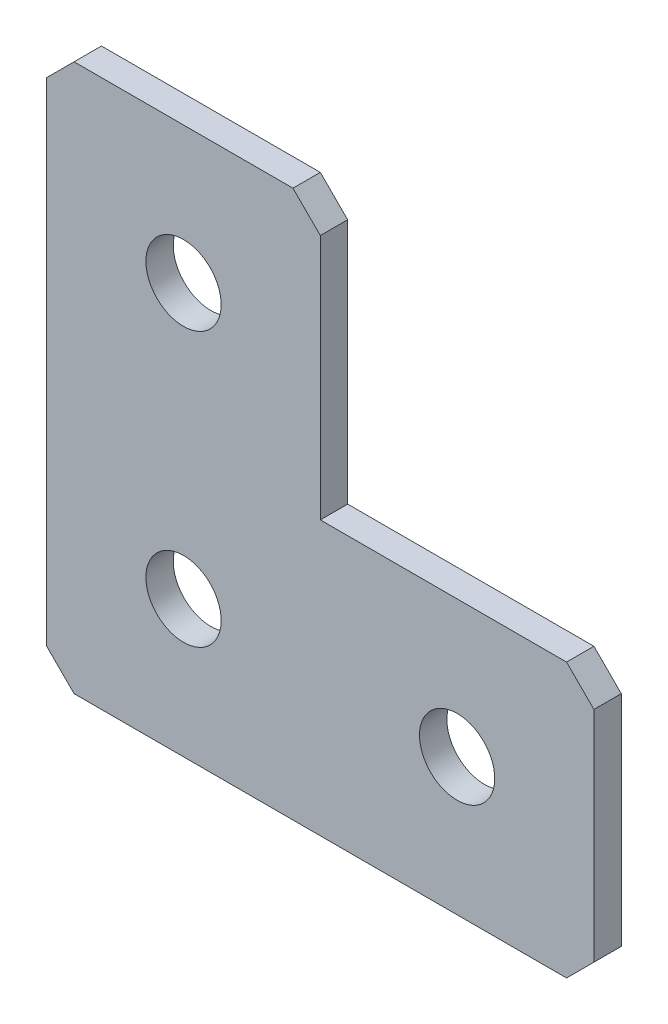
ISO-10303-21;
HEADER;
FILE_DESCRIPTION(('STEP AP214'),'2;1');
FILE_NAME('part.step','',(''),(''),'','','');
FILE_SCHEMA(('AUTOMOTIVE_DESIGN { 1 0 10303 214 1 1 1 1 }'));
ENDSEC;
DATA;
#1=APPLICATION_CONTEXT('core data for automotive mechanical design processes');
#2=APPLICATION_PROTOCOL_DEFINITION('international standard','automotive_design',2000,#1);
#3=PRODUCT_CONTEXT('',#1,'mechanical');
#4=PRODUCT('Part','Part','',(#3));
#5=PRODUCT_RELATED_PRODUCT_CATEGORY('part','',(#4));
#6=PRODUCT_DEFINITION_FORMATION('','',#4);
#7=PRODUCT_DEFINITION_CONTEXT('part definition',#1,'design');
#8=PRODUCT_DEFINITION('design','',#6,#7);
#9=PRODUCT_DEFINITION_SHAPE('','',#8);
#10=(LENGTH_UNIT() NAMED_UNIT(*) SI_UNIT(.MILLI.,.METRE.));
#11=(NAMED_UNIT(*) PLANE_ANGLE_UNIT() SI_UNIT($,.RADIAN.));
#12=(NAMED_UNIT(*) SI_UNIT($,.STERADIAN.) SOLID_ANGLE_UNIT());
#13=UNCERTAINTY_MEASURE_WITH_UNIT(LENGTH_MEASURE(1.E-05),#10,'distance_accuracy_value','');
#14=(GEOMETRIC_REPRESENTATION_CONTEXT(3) GLOBAL_UNCERTAINTY_ASSIGNED_CONTEXT((#13)) GLOBAL_UNIT_ASSIGNED_CONTEXT((#10,
#11,#12)) REPRESENTATION_CONTEXT('',''));
#15=CARTESIAN_POINT('',(0.,0.,0.));
#16=DIRECTION('',(0.,0.,1.));
#17=DIRECTION('',(1.,0.,0.));
#18=AXIS2_PLACEMENT_3D('',#15,#16,#17);
#19=CARTESIAN_POINT('',(20.,0.,-2.));
#20=DIRECTION('',(0.,-1.,0.));
#21=DIRECTION('',(1.,0.,0.));
#22=AXIS2_PLACEMENT_3D('',#19,#20,#21);
#23=PLANE('',#22);
#24=DIRECTION('',(1.,0.,0.));
#25=VECTOR('',#24,1.);
#26=CARTESIAN_POINT('',(20.,0.,-2.));
#27=LINE('',#26,#25);
#28=CARTESIAN_POINT('',(2.,0.,-2.));
#29=VERTEX_POINT('',#28);
#30=CARTESIAN_POINT('',(18.,0.,-2.));
#31=VERTEX_POINT('',#30);
#32=EDGE_CURVE('E140',#29,#31,#27,.T.);
#33=ORIENTED_EDGE('',*,*,#32,.F.);
#34=DIRECTION('',(0.,0.,1.));
#35=VECTOR('',#34,1.);
#36=CARTESIAN_POINT('',(2.,0.,-2.));
#37=LINE('',#36,#35);
#38=CARTESIAN_POINT('',(2.,0.,0.));
#39=VERTEX_POINT('',#38);
#40=EDGE_CURVE('E193',#29,#39,#37,.T.);
#41=ORIENTED_EDGE('',*,*,#40,.T.);
#42=DIRECTION('',(1.,0.,0.));
#43=VECTOR('',#42,1.);
#44=CARTESIAN_POINT('',(20.,0.,0.));
#45=LINE('',#44,#43);
#46=CARTESIAN_POINT('',(18.,0.,0.));
#47=VERTEX_POINT('',#46);
#48=EDGE_CURVE('E170',#39,#47,#45,.T.);
#49=ORIENTED_EDGE('',*,*,#48,.T.);
#50=DIRECTION('',(0.,0.,-1.));
#51=VECTOR('',#50,1.);
#52=CARTESIAN_POINT('',(18.,0.,-2.));
#53=LINE('',#52,#51);
#54=EDGE_CURVE('E151',#47,#31,#53,.T.);
#55=ORIENTED_EDGE('',*,*,#54,.T.);
#56=EDGE_LOOP('',(#33,#41,#49,#55));
#57=FACE_BOUND('',#56,.T.);
#58=ADVANCED_FACE('F42',(#57),#23,.F.);
#59=CARTESIAN_POINT('',(20.,-20.,-2.));
#60=DIRECTION('',(-1.,0.,0.));
#61=DIRECTION('',(0.,-1.,0.));
#62=AXIS2_PLACEMENT_3D('',#59,#60,#61);
#63=PLANE('',#62);
#64=DIRECTION('',(0.,-1.,0.));
#65=VECTOR('',#64,1.);
#66=CARTESIAN_POINT('',(20.,-20.,-2.));
#67=LINE('',#66,#65);
#68=CARTESIAN_POINT('',(20.,-2.,-2.));
#69=VERTEX_POINT('',#68);
#70=CARTESIAN_POINT('',(20.,-20.,-2.));
#71=VERTEX_POINT('',#70);
#72=EDGE_CURVE('E126',#69,#71,#67,.T.);
#73=ORIENTED_EDGE('',*,*,#72,.F.);
#74=DIRECTION('',(0.,0.,1.));
#75=VECTOR('',#74,1.);
#76=CARTESIAN_POINT('',(20.,-2.,-2.));
#77=LINE('',#76,#75);
#78=CARTESIAN_POINT('',(20.,-2.,0.));
#79=VERTEX_POINT('',#78);
#80=EDGE_CURVE('E232',#69,#79,#77,.T.);
#81=ORIENTED_EDGE('',*,*,#80,.T.);
#82=DIRECTION('',(0.,-1.,0.));
#83=VECTOR('',#82,1.);
#84=CARTESIAN_POINT('',(20.,-20.,0.));
#85=LINE('',#84,#83);
#86=CARTESIAN_POINT('',(20.,-20.,0.));
#87=VERTEX_POINT('',#86);
#88=EDGE_CURVE('E146',#79,#87,#85,.T.);
#89=ORIENTED_EDGE('',*,*,#88,.T.);
#90=DIRECTION('',(0.,0.,1.));
#91=VECTOR('',#90,1.);
#92=CARTESIAN_POINT('',(20.,-20.,-2.));
#93=LINE('',#92,#91);
#94=EDGE_CURVE('E143',#71,#87,#93,.T.);
#95=ORIENTED_EDGE('',*,*,#94,.F.);
#96=EDGE_LOOP('',(#73,#81,#89,#95));
#97=FACE_BOUND('',#96,.T.);
#98=ADVANCED_FACE('F144',(#97),#63,.F.);
#99=CARTESIAN_POINT('',(40.,-20.,-2.));
#100=DIRECTION('',(0.,-1.,0.));
#101=DIRECTION('',(0.,0.,-1.));
#102=AXIS2_PLACEMENT_3D('',#99,#100,#101);
#103=PLANE('',#102);
#104=DIRECTION('',(1.,0.,0.));
#105=VECTOR('',#104,1.);
#106=CARTESIAN_POINT('',(40.,-20.,0.));
#107=LINE('',#106,#105);
#108=CARTESIAN_POINT('',(38.,-20.,0.));
#109=VERTEX_POINT('',#108);
#110=EDGE_CURVE('E177',#87,#109,#107,.T.);
#111=ORIENTED_EDGE('',*,*,#110,.T.);
#112=DIRECTION('',(0.,0.,-1.));
#113=VECTOR('',#112,1.);
#114=CARTESIAN_POINT('',(38.,-20.,-2.));
#115=LINE('',#114,#113);
#116=CARTESIAN_POINT('',(38.,-20.,-2.));
#117=VERTEX_POINT('',#116);
#118=EDGE_CURVE('E156',#109,#117,#115,.T.);
#119=ORIENTED_EDGE('',*,*,#118,.T.);
#120=DIRECTION('',(1.,0.,0.));
#121=VECTOR('',#120,1.);
#122=CARTESIAN_POINT('',(40.,-20.,-2.));
#123=LINE('',#122,#121);
#124=EDGE_CURVE('E131',#71,#117,#123,.T.);
#125=ORIENTED_EDGE('',*,*,#124,.F.);
#126=ORIENTED_EDGE('',*,*,#94,.T.);
#127=EDGE_LOOP('',(#111,#119,#125,#126));
#128=FACE_BOUND('',#127,.T.);
#129=ADVANCED_FACE('F154',(#128),#103,.F.);
#130=CARTESIAN_POINT('',(40.,-40.,-2.));
#131=DIRECTION('',(-1.,0.,0.));
#132=DIRECTION('',(0.,0.,1.));
#133=AXIS2_PLACEMENT_3D('',#130,#131,#132);
#134=PLANE('',#133);
#135=DIRECTION('',(0.,-1.,0.));
#136=VECTOR('',#135,1.);
#137=CARTESIAN_POINT('',(40.,-40.,-2.));
#138=LINE('',#137,#136);
#139=CARTESIAN_POINT('',(40.,-22.,-2.));
#140=VERTEX_POINT('',#139);
#141=CARTESIAN_POINT('',(40.,-38.,-2.));
#142=VERTEX_POINT('',#141);
#143=EDGE_CURVE('E158',#140,#142,#138,.T.);
#144=ORIENTED_EDGE('',*,*,#143,.F.);
#145=DIRECTION('',(0.,0.,1.));
#146=VECTOR('',#145,1.);
#147=CARTESIAN_POINT('',(40.,-22.,-2.));
#148=LINE('',#147,#146);
#149=CARTESIAN_POINT('',(40.,-22.,0.));
#150=VERTEX_POINT('',#149);
#151=EDGE_CURVE('E238',#140,#150,#148,.T.);
#152=ORIENTED_EDGE('',*,*,#151,.T.);
#153=DIRECTION('',(0.,-1.,0.));
#154=VECTOR('',#153,1.);
#155=CARTESIAN_POINT('',(40.,-40.,0.));
#156=LINE('',#155,#154);
#157=CARTESIAN_POINT('',(40.,-38.,0.));
#158=VERTEX_POINT('',#157);
#159=EDGE_CURVE('E180',#150,#158,#156,.T.);
#160=ORIENTED_EDGE('',*,*,#159,.T.);
#161=DIRECTION('',(0.,0.,-1.));
#162=VECTOR('',#161,1.);
#163=CARTESIAN_POINT('',(40.,-38.,-2.));
#164=LINE('',#163,#162);
#165=EDGE_CURVE('E235',#158,#142,#164,.T.);
#166=ORIENTED_EDGE('',*,*,#165,.T.);
#167=EDGE_LOOP('',(#144,#152,#160,#166));
#168=FACE_BOUND('',#167,.T.);
#169=ADVANCED_FACE('F418',(#168),#134,.F.);
#170=CARTESIAN_POINT('',(0.,-40.,-2.));
#171=DIRECTION('',(0.,1.,0.));
#172=DIRECTION('',(0.,0.,1.));
#173=AXIS2_PLACEMENT_3D('',#170,#171,#172);
#174=PLANE('',#173);
#175=DIRECTION('',(-1.,0.,0.));
#176=VECTOR('',#175,1.);
#177=CARTESIAN_POINT('',(0.,-40.,-2.));
#178=LINE('',#177,#176);
#179=CARTESIAN_POINT('',(38.,-40.,-2.));
#180=VERTEX_POINT('',#179);
#181=CARTESIAN_POINT('',(2.,-40.,-2.));
#182=VERTEX_POINT('',#181);
#183=EDGE_CURVE('E162',#180,#182,#178,.T.);
#184=ORIENTED_EDGE('',*,*,#183,.F.);
#185=DIRECTION('',(0.,0.,1.));
#186=VECTOR('',#185,1.);
#187=CARTESIAN_POINT('',(38.,-40.,-2.));
#188=LINE('',#187,#186);
#189=CARTESIAN_POINT('',(38.,-40.,0.));
#190=VERTEX_POINT('',#189);
#191=EDGE_CURVE('E11',#180,#190,#188,.T.);
#192=ORIENTED_EDGE('',*,*,#191,.T.);
#193=DIRECTION('',(-1.,0.,0.));
#194=VECTOR('',#193,1.);
#195=CARTESIAN_POINT('',(0.,-40.,0.));
#196=LINE('',#195,#194);
#197=CARTESIAN_POINT('',(2.,-40.,0.));
#198=VERTEX_POINT('',#197);
#199=EDGE_CURVE('E184',#190,#198,#196,.T.);
#200=ORIENTED_EDGE('',*,*,#199,.T.);
#201=DIRECTION('',(0.,0.,-1.));
#202=VECTOR('',#201,1.);
#203=CARTESIAN_POINT('',(2.,-40.,-2.));
#204=LINE('',#203,#202);
#205=EDGE_CURVE('E51',#198,#182,#204,.T.);
#206=ORIENTED_EDGE('',*,*,#205,.T.);
#207=EDGE_LOOP('',(#184,#192,#200,#206));
#208=FACE_BOUND('',#207,.T.);
#209=ADVANCED_FACE('F402',(#208),#174,.F.);
#210=CARTESIAN_POINT('',(0.,0.,-2.));
#211=DIRECTION('',(1.,0.,0.));
#212=DIRECTION('',(0.,0.,-1.));
#213=AXIS2_PLACEMENT_3D('',#210,#211,#212);
#214=PLANE('',#213);
#215=DIRECTION('',(0.,1.,0.));
#216=VECTOR('',#215,1.);
#217=CARTESIAN_POINT('',(0.,0.,0.));
#218=LINE('',#217,#216);
#219=CARTESIAN_POINT('',(0.,-38.,0.));
#220=VERTEX_POINT('',#219);
#221=CARTESIAN_POINT('',(0.,-2.00000000000001,0.));
#222=VERTEX_POINT('',#221);
#223=EDGE_CURVE('E187',#220,#222,#218,.T.);
#224=ORIENTED_EDGE('',*,*,#223,.T.);
#225=DIRECTION('',(0.,0.,-1.));
#226=VECTOR('',#225,1.);
#227=CARTESIAN_POINT('',(0.,-2.00000000000001,-2.));
#228=LINE('',#227,#226);
#229=CARTESIAN_POINT('',(0.,-2.00000000000001,-2.));
#230=VERTEX_POINT('',#229);
#231=EDGE_CURVE('E216',#222,#230,#228,.T.);
#232=ORIENTED_EDGE('',*,*,#231,.T.);
#233=DIRECTION('',(0.,1.,0.));
#234=VECTOR('',#233,1.);
#235=CARTESIAN_POINT('',(0.,0.,-2.));
#236=LINE('',#235,#234);
#237=CARTESIAN_POINT('',(0.,-38.,-2.));
#238=VERTEX_POINT('',#237);
#239=EDGE_CURVE('E152',#238,#230,#236,.T.);
#240=ORIENTED_EDGE('',*,*,#239,.F.);
#241=DIRECTION('',(0.,0.,1.));
#242=VECTOR('',#241,1.);
#243=CARTESIAN_POINT('',(0.,-38.,-2.));
#244=LINE('',#243,#242);
#245=EDGE_CURVE('E212',#238,#220,#244,.T.);
#246=ORIENTED_EDGE('',*,*,#245,.T.);
#247=EDGE_LOOP('',(#224,#232,#240,#246));
#248=FACE_BOUND('',#247,.T.);
#249=ADVANCED_FACE('F351',(#248),#214,.F.);
#250=CARTESIAN_POINT('',(0.,0.,-2.));
#251=DIRECTION('',(0.,0.,1.));
#252=DIRECTION('',(1.,0.,0.));
#253=AXIS2_PLACEMENT_3D('',#250,#251,#252);
#254=PLANE('',#253);
#255=CARTESIAN_POINT('',(10.,-30.,-2.));
#256=DIRECTION('',(0.,0.,-1.));
#257=DIRECTION('',(0.,1.,0.));
#258=AXIS2_PLACEMENT_3D('',#255,#256,#257);
#259=CIRCLE('',#258,2.75);
#260=CARTESIAN_POINT('',(10.,-27.25,-2.));
#261=VERTEX_POINT('',#260);
#262=EDGE_CURVE('E338',#261,#261,#259,.T.);
#263=ORIENTED_EDGE('',*,*,#262,.F.);
#264=EDGE_LOOP('',(#263));
#265=FACE_BOUND('',#264,.T.);
#266=CARTESIAN_POINT('',(10.,-9.99999999999999,-2.));
#267=DIRECTION('',(0.,0.,-1.));
#268=DIRECTION('',(0.,1.,0.));
#269=AXIS2_PLACEMENT_3D('',#266,#267,#268);
#270=CIRCLE('',#269,2.75);
#271=CARTESIAN_POINT('',(10.,-7.24999999999999,-2.));
#272=VERTEX_POINT('',#271);
#273=EDGE_CURVE('E326',#272,#272,#270,.T.);
#274=ORIENTED_EDGE('',*,*,#273,.F.);
#275=EDGE_LOOP('',(#274));
#276=FACE_BOUND('',#275,.T.);
#277=CARTESIAN_POINT('',(30.,-30.,-2.));
#278=DIRECTION('',(0.,0.,-1.));
#279=DIRECTION('',(0.,1.,0.));
#280=AXIS2_PLACEMENT_3D('',#277,#278,#279);
#281=CIRCLE('',#280,2.75);
#282=CARTESIAN_POINT('',(30.,-27.25,-2.));
#283=VERTEX_POINT('',#282);
#284=EDGE_CURVE('E314',#283,#283,#281,.T.);
#285=ORIENTED_EDGE('',*,*,#284,.F.);
#286=EDGE_LOOP('',(#285));
#287=FACE_BOUND('',#286,.T.);
#288=ORIENTED_EDGE('',*,*,#239,.T.);
#289=DIRECTION('',(-0.707106781186546,-0.707106781186549,0.));
#290=VECTOR('',#289,1.);
#291=CARTESIAN_POINT('',(2.,0.,-2.));
#292=LINE('',#291,#290);
#293=EDGE_CURVE('E229',#230,#29,#292,.F.);
#294=ORIENTED_EDGE('',*,*,#293,.T.);
#295=ORIENTED_EDGE('',*,*,#32,.T.);
#296=DIRECTION('',(-0.707106781186549,0.707106781186546,0.));
#297=VECTOR('',#296,1.);
#298=CARTESIAN_POINT('',(20.,-2.,-2.));
#299=LINE('',#298,#297);
#300=EDGE_CURVE('E135',#31,#69,#299,.F.);
#301=ORIENTED_EDGE('',*,*,#300,.T.);
#302=ORIENTED_EDGE('',*,*,#72,.T.);
#303=ORIENTED_EDGE('',*,*,#124,.T.);
#304=DIRECTION('',(-0.707106781186549,0.707106781186546,0.));
#305=VECTOR('',#304,1.);
#306=CARTESIAN_POINT('',(40.,-22.,-2.));
#307=LINE('',#306,#305);
#308=EDGE_CURVE('E224',#117,#140,#307,.F.);
#309=ORIENTED_EDGE('',*,*,#308,.T.);
#310=ORIENTED_EDGE('',*,*,#143,.T.);
#311=DIRECTION('',(0.707106781186546,0.707106781186549,0.));
#312=VECTOR('',#311,1.);
#313=CARTESIAN_POINT('',(38.,-40.,-2.));
#314=LINE('',#313,#312);
#315=EDGE_CURVE('E64',#142,#180,#314,.F.);
#316=ORIENTED_EDGE('',*,*,#315,.T.);
#317=ORIENTED_EDGE('',*,*,#183,.T.);
#318=DIRECTION('',(0.707106781186549,-0.707106781186546,0.));
#319=VECTOR('',#318,1.);
#320=CARTESIAN_POINT('',(0.,-38.,-2.));
#321=LINE('',#320,#319);
#322=EDGE_CURVE('E219',#182,#238,#321,.F.);
#323=ORIENTED_EDGE('',*,*,#322,.T.);
#324=EDGE_LOOP('',(#288,#294,#295,#301,#302,#303,#309,#310,#316,#317,#323));
#325=FACE_BOUND('',#324,.T.);
#326=ADVANCED_FACE('F129',(#265,#276,#287,#325),#254,.F.);
#327=CARTESIAN_POINT('',(0.,0.,0.));
#328=DIRECTION('',(0.,0.,1.));
#329=DIRECTION('',(1.,0.,0.));
#330=AXIS2_PLACEMENT_3D('',#327,#328,#329);
#331=PLANE('',#330);
#332=CARTESIAN_POINT('',(10.,-30.,0.));
#333=DIRECTION('',(0.,0.,-1.));
#334=DIRECTION('',(0.,1.,0.));
#335=AXIS2_PLACEMENT_3D('',#332,#333,#334);
#336=CIRCLE('',#335,2.75);
#337=CARTESIAN_POINT('',(10.,-27.25,0.));
#338=VERTEX_POINT('',#337);
#339=EDGE_CURVE('E332',#338,#338,#336,.T.);
#340=ORIENTED_EDGE('',*,*,#339,.T.);
#341=EDGE_LOOP('',(#340));
#342=FACE_BOUND('',#341,.T.);
#343=CARTESIAN_POINT('',(10.,-9.99999999999999,0.));
#344=DIRECTION('',(0.,0.,-1.));
#345=DIRECTION('',(0.,1.,0.));
#346=AXIS2_PLACEMENT_3D('',#343,#344,#345);
#347=CIRCLE('',#346,2.75);
#348=CARTESIAN_POINT('',(10.,-7.25,0.));
#349=VERTEX_POINT('',#348);
#350=EDGE_CURVE('E320',#349,#349,#347,.T.);
#351=ORIENTED_EDGE('',*,*,#350,.T.);
#352=EDGE_LOOP('',(#351));
#353=FACE_BOUND('',#352,.T.);
#354=CARTESIAN_POINT('',(30.,-30.,0.));
#355=DIRECTION('',(0.,0.,-1.));
#356=DIRECTION('',(0.,1.,0.));
#357=AXIS2_PLACEMENT_3D('',#354,#355,#356);
#358=CIRCLE('',#357,2.75);
#359=CARTESIAN_POINT('',(30.,-27.25,0.));
#360=VERTEX_POINT('',#359);
#361=EDGE_CURVE('E174',#360,#360,#358,.T.);
#362=ORIENTED_EDGE('',*,*,#361,.T.);
#363=EDGE_LOOP('',(#362));
#364=FACE_BOUND('',#363,.T.);
#365=ORIENTED_EDGE('',*,*,#48,.F.);
#366=DIRECTION('',(0.707106781186546,0.707106781186549,0.));
#367=VECTOR('',#366,1.);
#368=CARTESIAN_POINT('',(1.,-1.,0.));
#369=LINE('',#368,#367);
#370=EDGE_CURVE('E209',#39,#222,#369,.F.);
#371=ORIENTED_EDGE('',*,*,#370,.T.);
#372=ORIENTED_EDGE('',*,*,#223,.F.);
#373=DIRECTION('',(-0.707106781186549,0.707106781186546,0.));
#374=VECTOR('',#373,1.);
#375=CARTESIAN_POINT('',(-19.,-19.0000000000001,0.));
#376=LINE('',#375,#374);
#377=EDGE_CURVE('E197',#220,#198,#376,.F.);
#378=ORIENTED_EDGE('',*,*,#377,.T.);
#379=ORIENTED_EDGE('',*,*,#199,.F.);
#380=DIRECTION('',(-0.707106781186546,-0.707106781186549,0.));
#381=VECTOR('',#380,1.);
#382=CARTESIAN_POINT('',(39.0000000000001,-38.9999999999999,0.));
#383=LINE('',#382,#381);
#384=EDGE_CURVE('E200',#190,#158,#383,.F.);
#385=ORIENTED_EDGE('',*,*,#384,.T.);
#386=ORIENTED_EDGE('',*,*,#159,.F.);
#387=DIRECTION('',(0.707106781186549,-0.707106781186546,0.));
#388=VECTOR('',#387,1.);
#389=CARTESIAN_POINT('',(8.99999999999993,8.99999999999996,0.));
#390=LINE('',#389,#388);
#391=EDGE_CURVE('E203',#150,#109,#390,.F.);
#392=ORIENTED_EDGE('',*,*,#391,.T.);
#393=ORIENTED_EDGE('',*,*,#110,.F.);
#394=ORIENTED_EDGE('',*,*,#88,.F.);
#395=DIRECTION('',(0.707106781186549,-0.707106781186546,0.));
#396=VECTOR('',#395,1.);
#397=CARTESIAN_POINT('',(8.99999999999996,9.,0.));
#398=LINE('',#397,#396);
#399=EDGE_CURVE('E206',#79,#47,#398,.F.);
#400=ORIENTED_EDGE('',*,*,#399,.T.);
#401=EDGE_LOOP('',(#365,#371,#372,#378,#379,#385,#386,#392,#393,#394,#400));
#402=FACE_BOUND('',#401,.T.);
#403=ADVANCED_FACE('F350',(#342,#353,#364,#402),#331,.T.);
#404=CARTESIAN_POINT('',(30.,-30.,-2.));
#405=DIRECTION('',(0.,0.,-1.));
#406=DIRECTION('',(0.,1.,0.));
#407=AXIS2_PLACEMENT_3D('',#404,#405,#406);
#408=CYLINDRICAL_SURFACE('',#407,2.75);
#409=ORIENTED_EDGE('',*,*,#361,.F.);
#410=EDGE_LOOP('',(#409));
#411=FACE_BOUND('',#410,.T.);
#412=ORIENTED_EDGE('',*,*,#284,.T.);
#413=EDGE_LOOP('',(#412));
#414=FACE_BOUND('',#413,.T.);
#415=ADVANCED_FACE('F357',(#411,#414),#408,.F.);
#416=CARTESIAN_POINT('',(10.,-9.99999999999999,-2.));
#417=DIRECTION('',(0.,0.,-1.));
#418=DIRECTION('',(0.,1.,0.));
#419=AXIS2_PLACEMENT_3D('',#416,#417,#418);
#420=CYLINDRICAL_SURFACE('',#419,2.75);
#421=ORIENTED_EDGE('',*,*,#350,.F.);
#422=EDGE_LOOP('',(#421));
#423=FACE_BOUND('',#422,.T.);
#424=ORIENTED_EDGE('',*,*,#273,.T.);
#425=EDGE_LOOP('',(#424));
#426=FACE_BOUND('',#425,.T.);
#427=ADVANCED_FACE('F359',(#423,#426),#420,.F.);
#428=CARTESIAN_POINT('',(10.,-30.,-2.));
#429=DIRECTION('',(0.,0.,-1.));
#430=DIRECTION('',(0.,1.,0.));
#431=AXIS2_PLACEMENT_3D('',#428,#429,#430);
#432=CYLINDRICAL_SURFACE('',#431,2.75);
#433=ORIENTED_EDGE('',*,*,#339,.F.);
#434=EDGE_LOOP('',(#433));
#435=FACE_BOUND('',#434,.T.);
#436=ORIENTED_EDGE('',*,*,#262,.T.);
#437=EDGE_LOOP('',(#436));
#438=FACE_BOUND('',#437,.T.);
#439=ADVANCED_FACE('F346',(#435,#438),#432,.F.);
#440=CARTESIAN_POINT('',(2.,0.,-2.));
#441=DIRECTION('',(0.707106781186549,-0.707106781186546,0.));
#442=DIRECTION('',(0.,0.,1.));
#443=AXIS2_PLACEMENT_3D('',#440,#441,#442);
#444=PLANE('',#443);
#445=ORIENTED_EDGE('',*,*,#293,.F.);
#446=ORIENTED_EDGE('',*,*,#231,.F.);
#447=ORIENTED_EDGE('',*,*,#370,.F.);
#448=ORIENTED_EDGE('',*,*,#40,.F.);
#449=EDGE_LOOP('',(#445,#446,#447,#448));
#450=FACE_BOUND('',#449,.T.);
#451=ADVANCED_FACE('F381',(#450),#444,.F.);
#452=CARTESIAN_POINT('',(20.,-2.,-2.));
#453=DIRECTION('',(-0.707106781186546,-0.707106781186549,0.));
#454=DIRECTION('',(0.,0.,1.));
#455=AXIS2_PLACEMENT_3D('',#452,#453,#454);
#456=PLANE('',#455);
#457=ORIENTED_EDGE('',*,*,#300,.F.);
#458=ORIENTED_EDGE('',*,*,#54,.F.);
#459=ORIENTED_EDGE('',*,*,#399,.F.);
#460=ORIENTED_EDGE('',*,*,#80,.F.);
#461=EDGE_LOOP('',(#457,#458,#459,#460));
#462=FACE_BOUND('',#461,.T.);
#463=ADVANCED_FACE('F384',(#462),#456,.F.);
#464=CARTESIAN_POINT('',(40.,-22.,-2.));
#465=DIRECTION('',(-0.707106781186546,-0.707106781186549,0.));
#466=DIRECTION('',(0.,0.,1.));
#467=AXIS2_PLACEMENT_3D('',#464,#465,#466);
#468=PLANE('',#467);
#469=ORIENTED_EDGE('',*,*,#308,.F.);
#470=ORIENTED_EDGE('',*,*,#118,.F.);
#471=ORIENTED_EDGE('',*,*,#391,.F.);
#472=ORIENTED_EDGE('',*,*,#151,.F.);
#473=EDGE_LOOP('',(#469,#470,#471,#472));
#474=FACE_BOUND('',#473,.T.);
#475=ADVANCED_FACE('F388',(#474),#468,.F.);
#476=CARTESIAN_POINT('',(38.,-40.,-2.));
#477=DIRECTION('',(-0.707106781186549,0.707106781186546,0.));
#478=DIRECTION('',(0.,0.,1.));
#479=AXIS2_PLACEMENT_3D('',#476,#477,#478);
#480=PLANE('',#479);
#481=ORIENTED_EDGE('',*,*,#315,.F.);
#482=ORIENTED_EDGE('',*,*,#165,.F.);
#483=ORIENTED_EDGE('',*,*,#384,.F.);
#484=ORIENTED_EDGE('',*,*,#191,.F.);
#485=EDGE_LOOP('',(#481,#482,#483,#484));
#486=FACE_BOUND('',#485,.T.);
#487=ADVANCED_FACE('F391',(#486),#480,.F.);
#488=CARTESIAN_POINT('',(0.,-38.,-2.));
#489=DIRECTION('',(0.707106781186546,0.707106781186549,0.));
#490=DIRECTION('',(0.,0.,1.));
#491=AXIS2_PLACEMENT_3D('',#488,#489,#490);
#492=PLANE('',#491);
#493=ORIENTED_EDGE('',*,*,#322,.F.);
#494=ORIENTED_EDGE('',*,*,#205,.F.);
#495=ORIENTED_EDGE('',*,*,#377,.F.);
#496=ORIENTED_EDGE('',*,*,#245,.F.);
#497=EDGE_LOOP('',(#493,#494,#495,#496));
#498=FACE_BOUND('',#497,.T.);
#499=ADVANCED_FACE('F44',(#498),#492,.F.);
#500=CLOSED_SHELL('',(#58,#98,#129,#169,#209,#249,#326,#403,#415,#427,#439,#451,#463,#475,#487,#499));
#501=MANIFOLD_SOLID_BREP('B2',#500);
#502=ADVANCED_BREP_SHAPE_REPRESENTATION('',(#18,#501),#14);
#503=SHAPE_DEFINITION_REPRESENTATION(#9,#502);
ENDSEC;
END-ISO-10303-21;
